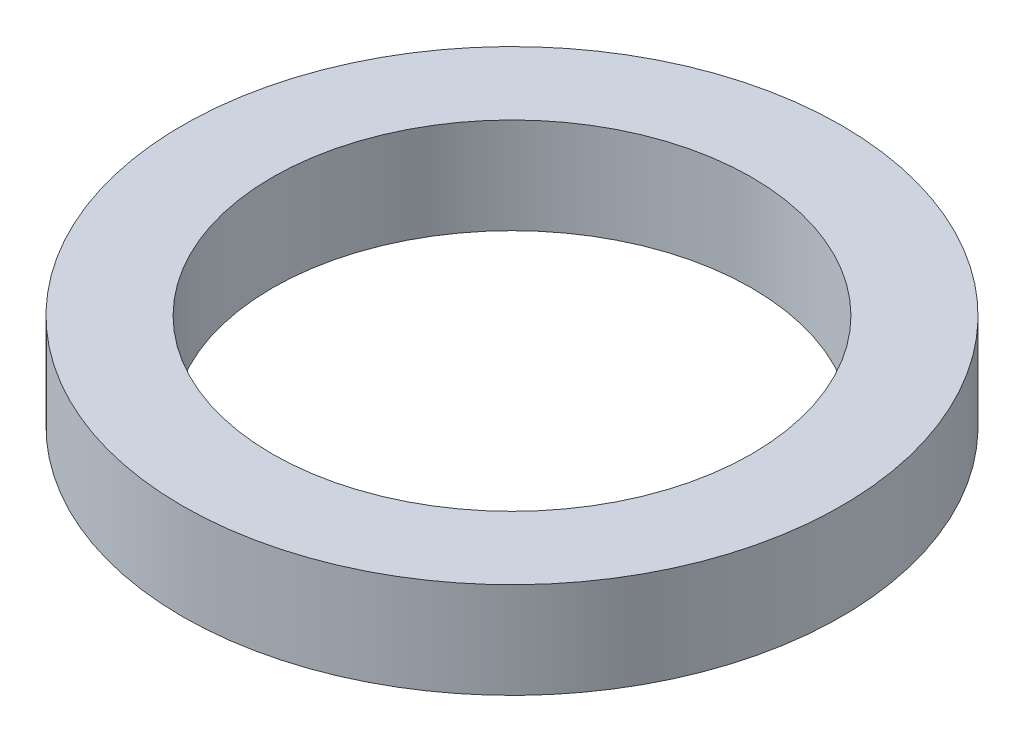
ISO-10303-21;
HEADER;
FILE_DESCRIPTION(('STEP AP214'),'2;1');
FILE_NAME('part.step','',(''),(''),'','','');
FILE_SCHEMA(('AUTOMOTIVE_DESIGN { 1 0 10303 214 1 1 1 1 }'));
ENDSEC;
DATA;
#1=APPLICATION_CONTEXT('core data for automotive mechanical design processes');
#2=APPLICATION_PROTOCOL_DEFINITION('international standard','automotive_design',2000,#1);
#3=PRODUCT_CONTEXT('',#1,'mechanical');
#4=PRODUCT('Part','Part','',(#3));
#5=PRODUCT_RELATED_PRODUCT_CATEGORY('part','',(#4));
#6=PRODUCT_DEFINITION_FORMATION('','',#4);
#7=PRODUCT_DEFINITION_CONTEXT('part definition',#1,'design');
#8=PRODUCT_DEFINITION('design','',#6,#7);
#9=PRODUCT_DEFINITION_SHAPE('','',#8);
#10=(LENGTH_UNIT() NAMED_UNIT(*) SI_UNIT(.MILLI.,.METRE.));
#11=(NAMED_UNIT(*) PLANE_ANGLE_UNIT() SI_UNIT($,.RADIAN.));
#12=(NAMED_UNIT(*) SI_UNIT($,.STERADIAN.) SOLID_ANGLE_UNIT());
#13=UNCERTAINTY_MEASURE_WITH_UNIT(LENGTH_MEASURE(1.E-05),#10,'distance_accuracy_value','');
#14=(GEOMETRIC_REPRESENTATION_CONTEXT(3) GLOBAL_UNCERTAINTY_ASSIGNED_CONTEXT((#13)) GLOBAL_UNIT_ASSIGNED_CONTEXT((#10,
#11,#12)) REPRESENTATION_CONTEXT('',''));
#15=CARTESIAN_POINT('',(0.,0.,0.));
#16=DIRECTION('',(0.,0.,1.));
#17=DIRECTION('',(1.,0.,0.));
#18=AXIS2_PLACEMENT_3D('',#15,#16,#17);
#19=CARTESIAN_POINT('',(0.,8.,0.));
#20=DIRECTION('',(0.,-1.,0.));
#21=DIRECTION('',(0.,0.,-1.));
#22=AXIS2_PLACEMENT_3D('',#19,#20,#21);
#23=CYLINDRICAL_SURFACE('',#22,27.5);
#24=CARTESIAN_POINT('',(0.,8.,0.));
#25=DIRECTION('',(0.,1.,0.));
#26=DIRECTION('',(0.,0.,1.));
#27=AXIS2_PLACEMENT_3D('',#24,#25,#26);
#28=CIRCLE('',#27,27.5);
#29=CARTESIAN_POINT('',(0.,8.,27.5));
#30=VERTEX_POINT('',#29);
#31=EDGE_CURVE('E10',#30,#30,#28,.T.);
#32=ORIENTED_EDGE('',*,*,#31,.F.);
#33=EDGE_LOOP('',(#32));
#34=FACE_BOUND('',#33,.T.);
#35=CARTESIAN_POINT('',(0.,0.,0.));
#36=DIRECTION('',(0.,1.,0.));
#37=DIRECTION('',(0.,0.,1.));
#38=AXIS2_PLACEMENT_3D('',#35,#36,#37);
#39=CIRCLE('',#38,27.5);
#40=CARTESIAN_POINT('',(0.,0.,27.5));
#41=VERTEX_POINT('',#40);
#42=EDGE_CURVE('E37',#41,#41,#39,.T.);
#43=ORIENTED_EDGE('',*,*,#42,.T.);
#44=EDGE_LOOP('',(#43));
#45=FACE_BOUND('',#44,.T.);
#46=ADVANCED_FACE('F40',(#34,#45),#23,.T.);
#47=CARTESIAN_POINT('',(0.,8.,0.));
#48=DIRECTION('',(0.,1.,0.));
#49=DIRECTION('',(0.,0.,1.));
#50=AXIS2_PLACEMENT_3D('',#47,#48,#49);
#51=PLANE('',#50);
#52=CARTESIAN_POINT('',(0.,8.,0.));
#53=DIRECTION('',(0.,1.,0.));
#54=DIRECTION('',(0.,0.,1.));
#55=AXIS2_PLACEMENT_3D('',#52,#53,#54);
#56=CIRCLE('',#55,20.);
#57=CARTESIAN_POINT('',(0.,8.,20.));
#58=VERTEX_POINT('',#57);
#59=EDGE_CURVE('E50',#58,#58,#56,.T.);
#60=ORIENTED_EDGE('',*,*,#59,.F.);
#61=EDGE_LOOP('',(#60));
#62=FACE_BOUND('',#61,.T.);
#63=ORIENTED_EDGE('',*,*,#31,.T.);
#64=EDGE_LOOP('',(#63));
#65=FACE_BOUND('',#64,.T.);
#66=ADVANCED_FACE('F59',(#62,#65),#51,.T.);
#67=CARTESIAN_POINT('',(0.,0.,0.));
#68=DIRECTION('',(0.,1.,0.));
#69=DIRECTION('',(0.,0.,1.));
#70=AXIS2_PLACEMENT_3D('',#67,#68,#69);
#71=PLANE('',#70);
#72=CARTESIAN_POINT('',(0.,0.,0.));
#73=DIRECTION('',(0.,1.,0.));
#74=DIRECTION('',(0.,0.,1.));
#75=AXIS2_PLACEMENT_3D('',#72,#73,#74);
#76=CIRCLE('',#75,20.);
#77=CARTESIAN_POINT('',(0.,0.,20.));
#78=VERTEX_POINT('',#77);
#79=EDGE_CURVE('E47',#78,#78,#76,.T.);
#80=ORIENTED_EDGE('',*,*,#79,.T.);
#81=EDGE_LOOP('',(#80));
#82=FACE_BOUND('',#81,.T.);
#83=ORIENTED_EDGE('',*,*,#42,.F.);
#84=EDGE_LOOP('',(#83));
#85=FACE_BOUND('',#84,.T.);
#86=ADVANCED_FACE('F58',(#82,#85),#71,.F.);
#87=CARTESIAN_POINT('',(0.,8.,0.));
#88=DIRECTION('',(0.,-1.,0.));
#89=DIRECTION('',(0.,0.,-1.));
#90=AXIS2_PLACEMENT_3D('',#87,#88,#89);
#91=CYLINDRICAL_SURFACE('',#90,20.);
#92=ORIENTED_EDGE('',*,*,#59,.T.);
#93=EDGE_LOOP('',(#92));
#94=FACE_BOUND('',#93,.T.);
#95=ORIENTED_EDGE('',*,*,#79,.F.);
#96=EDGE_LOOP('',(#95));
#97=FACE_BOUND('',#96,.T.);
#98=ADVANCED_FACE('F54',(#94,#97),#91,.F.);
#99=CLOSED_SHELL('',(#46,#66,#86,#98));
#100=MANIFOLD_SOLID_BREP('B2',#99);
#101=ADVANCED_BREP_SHAPE_REPRESENTATION('',(#18,#100),#14);
#102=SHAPE_DEFINITION_REPRESENTATION(#9,#101);
ENDSEC;
END-ISO-10303-21;
